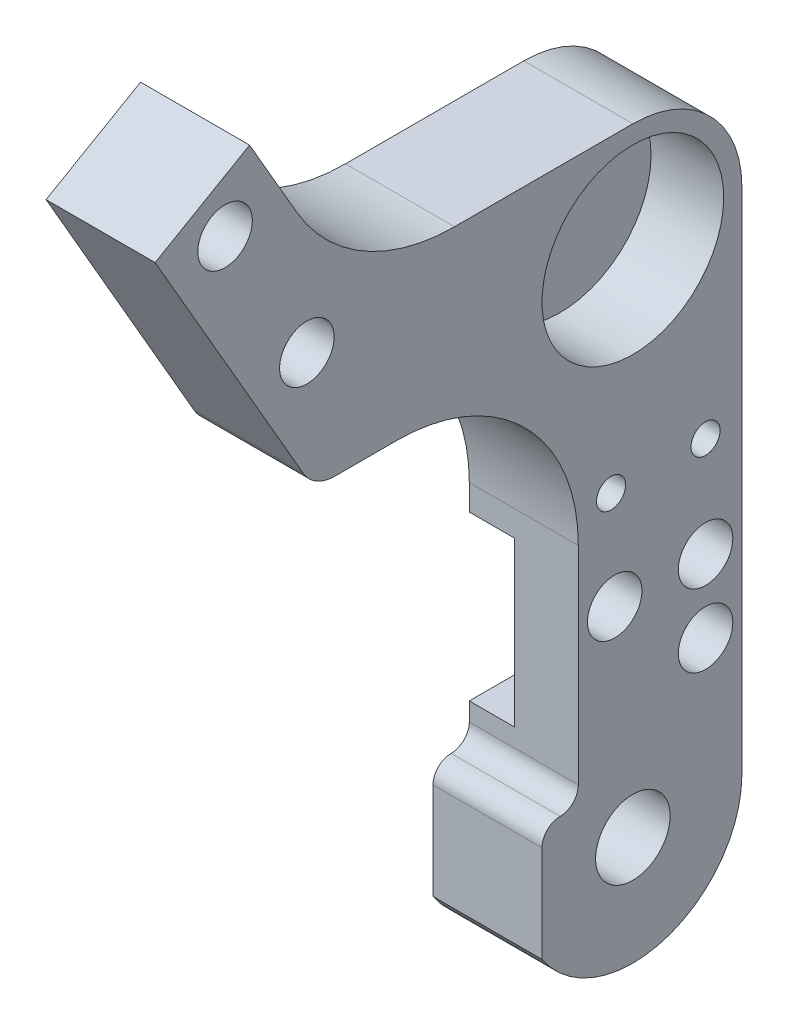
ISO-10303-21;
HEADER;
FILE_DESCRIPTION(('STEP AP214'),'2;1');
FILE_NAME('part.step','',(''),(''),'','','');
FILE_SCHEMA(('AUTOMOTIVE_DESIGN { 1 0 10303 214 1 1 1 1 }'));
ENDSEC;
DATA;
#1=APPLICATION_CONTEXT('core data for automotive mechanical design processes');
#2=APPLICATION_PROTOCOL_DEFINITION('international standard','automotive_design',2000,#1);
#3=PRODUCT_CONTEXT('',#1,'mechanical');
#4=PRODUCT('Part','Part','',(#3));
#5=PRODUCT_RELATED_PRODUCT_CATEGORY('part','',(#4));
#6=PRODUCT_DEFINITION_FORMATION('','',#4);
#7=PRODUCT_DEFINITION_CONTEXT('part definition',#1,'design');
#8=PRODUCT_DEFINITION('design','',#6,#7);
#9=PRODUCT_DEFINITION_SHAPE('','',#8);
#10=(LENGTH_UNIT() NAMED_UNIT(*) SI_UNIT(.MILLI.,.METRE.));
#11=(NAMED_UNIT(*) PLANE_ANGLE_UNIT() SI_UNIT($,.RADIAN.));
#12=(NAMED_UNIT(*) SI_UNIT($,.STERADIAN.) SOLID_ANGLE_UNIT());
#13=UNCERTAINTY_MEASURE_WITH_UNIT(LENGTH_MEASURE(1.E-05),#10,'distance_accuracy_value','');
#14=(GEOMETRIC_REPRESENTATION_CONTEXT(3) GLOBAL_UNCERTAINTY_ASSIGNED_CONTEXT((#13)) GLOBAL_UNIT_ASSIGNED_CONTEXT((#10,
#11,#12)) REPRESENTATION_CONTEXT('',''));
#15=CARTESIAN_POINT('',(0.,0.,0.));
#16=DIRECTION('',(0.,0.,1.));
#17=DIRECTION('',(1.,0.,0.));
#18=AXIS2_PLACEMENT_3D('',#15,#16,#17);
#19=CARTESIAN_POINT('',(0.,0.,0.));
#20=DIRECTION('',(-1.,0.,0.));
#21=DIRECTION('',(0.,0.,1.));
#22=AXIS2_PLACEMENT_3D('',#19,#20,#21);
#23=PLANE('',#22);
#24=DIRECTION('',(0.,0.,-1.));
#25=VECTOR('',#24,1.);
#26=CARTESIAN_POINT('',(0.,14.,-6.));
#27=LINE('',#26,#25);
#28=CARTESIAN_POINT('',(0.,14.,3.));
#29=VERTEX_POINT('',#28);
#30=CARTESIAN_POINT('',(0.,14.,-6.));
#31=VERTEX_POINT('',#30);
#32=EDGE_CURVE('E182',#29,#31,#27,.T.);
#33=ORIENTED_EDGE('',*,*,#32,.F.);
#34=DIRECTION('',(0.,-1.,0.));
#35=VECTOR('',#34,1.);
#36=CARTESIAN_POINT('',(0.,15.4051256642758,3.));
#37=LINE('',#36,#35);
#38=CARTESIAN_POINT('',(0.,15.4051256642758,3.));
#39=VERTEX_POINT('',#38);
#40=EDGE_CURVE('E293',#39,#29,#37,.T.);
#41=ORIENTED_EDGE('',*,*,#40,.F.);
#42=CARTESIAN_POINT('',(0.,15.4051256642758,13.));
#43=DIRECTION('',(-1.,0.,0.));
#44=DIRECTION('',(0.,0.,1.));
#45=AXIS2_PLACEMENT_3D('',#42,#43,#44);
#46=CIRCLE('',#45,10.);
#47=CARTESIAN_POINT('',(0.,25.4051256642758,13.));
#48=VERTEX_POINT('',#47);
#49=EDGE_CURVE('E290',#48,#39,#46,.T.);
#50=ORIENTED_EDGE('',*,*,#49,.F.);
#51=DIRECTION('',(0.,0.,-1.));
#52=VECTOR('',#51,1.);
#53=CARTESIAN_POINT('',(0.,25.4051256642758,16.3989745962155));
#54=LINE('',#53,#52);
#55=CARTESIAN_POINT('',(0.,25.4051256642758,16.3989745962155));
#56=VERTEX_POINT('',#55);
#57=EDGE_CURVE('E288',#56,#48,#54,.T.);
#58=ORIENTED_EDGE('',*,*,#57,.F.);
#59=CARTESIAN_POINT('',(0.,27.4051256642758,16.3989745962155));
#60=DIRECTION('',(1.,0.,0.));
#61=DIRECTION('',(0.,0.,-1.));
#62=AXIS2_PLACEMENT_3D('',#59,#60,#61);
#63=CIRCLE('',#62,2.);
#64=CARTESIAN_POINT('',(0.,26.4051256642758,18.1310254037844));
#65=VERTEX_POINT('',#64);
#66=EDGE_CURVE('E286',#65,#56,#63,.T.);
#67=ORIENTED_EDGE('',*,*,#66,.F.);
#68=DIRECTION('',(0.,-0.866025403784436,-0.500000000000004));
#69=VECTOR('',#68,1.);
#70=CARTESIAN_POINT('',(0.,40.53,26.2860254037844));
#71=LINE('',#70,#69);
#72=CARTESIAN_POINT('',(0.,40.53,26.2860254037844));
#73=VERTEX_POINT('',#72);
#74=EDGE_CURVE('E284',#73,#65,#71,.T.);
#75=ORIENTED_EDGE('',*,*,#74,.F.);
#76=DIRECTION('',(0.,-0.500000000000004,0.866025403784436));
#77=VECTOR('',#76,1.);
#78=CARTESIAN_POINT('',(0.,43.53,21.0898729810778));
#79=LINE('',#78,#77);
#80=CARTESIAN_POINT('',(0.,43.53,21.0898729810778));
#81=VERTEX_POINT('',#80);
#82=EDGE_CURVE('E282',#81,#73,#79,.T.);
#83=ORIENTED_EDGE('',*,*,#82,.F.);
#84=DIRECTION('',(0.,0.866025403784436,0.500000000000004));
#85=VECTOR('',#84,1.);
#86=CARTESIAN_POINT('',(0.,39.,18.4744762616488));
#87=LINE('',#86,#85);
#88=CARTESIAN_POINT('',(0.,39.,18.4744762616488));
#89=VERTEX_POINT('',#88);
#90=EDGE_CURVE('E280',#89,#81,#87,.T.);
#91=ORIENTED_EDGE('',*,*,#90,.F.);
#92=CARTESIAN_POINT('',(0.,44.,9.8142222238044));
#93=DIRECTION('',(-1.,0.,0.));
#94=DIRECTION('',(0.,0.,1.));
#95=AXIS2_PLACEMENT_3D('',#92,#93,#94);
#96=CIRCLE('',#95,10.);
#97=CARTESIAN_POINT('',(0.,34.,9.81422222380439));
#98=VERTEX_POINT('',#97);
#99=EDGE_CURVE('E278',#98,#89,#96,.T.);
#100=ORIENTED_EDGE('',*,*,#99,.F.);
#101=DIRECTION('',(0.,0.,1.));
#102=VECTOR('',#101,1.);
#103=CARTESIAN_POINT('',(0.,34.,0.));
#104=LINE('',#103,#102);
#105=CARTESIAN_POINT('',(0.,34.,0.));
#106=VERTEX_POINT('',#105);
#107=EDGE_CURVE('E276',#106,#98,#104,.T.);
#108=ORIENTED_EDGE('',*,*,#107,.F.);
#109=CARTESIAN_POINT('',(0.,28.,0.));
#110=DIRECTION('',(1.,0.,0.));
#111=DIRECTION('',(0.,0.,-1.));
#112=AXIS2_PLACEMENT_3D('',#109,#110,#111);
#113=CIRCLE('',#112,6.);
#114=CARTESIAN_POINT('',(0.,28.,-6.));
#115=VERTEX_POINT('',#114);
#116=EDGE_CURVE('E274',#115,#106,#113,.T.);
#117=ORIENTED_EDGE('',*,*,#116,.F.);
#118=DIRECTION('',(0.,1.,0.));
#119=VECTOR('',#118,1.);
#120=CARTESIAN_POINT('',(0.,0.,-6.));
#121=LINE('',#120,#119);
#122=EDGE_CURVE('E272',#31,#115,#121,.T.);
#123=ORIENTED_EDGE('',*,*,#122,.F.);
#124=EDGE_LOOP('',(#33,#41,#50,#58,#67,#75,#83,#91,#100,#108,#117,#123));
#125=FACE_BOUND('',#124,.T.);
#126=CARTESIAN_POINT('',(0.,39.8649364905389,22.4379491924311));
#127=DIRECTION('',(1.,0.,0.));
#128=DIRECTION('',(0.,0.,-1.));
#129=AXIS2_PLACEMENT_3D('',#126,#127,#128);
#130=CIRCLE('',#129,1.5);
#131=CARTESIAN_POINT('',(0.,39.8649364905389,20.9379491924311));
#132=VERTEX_POINT('',#131);
#133=EDGE_CURVE('E226',#132,#132,#130,.T.);
#134=ORIENTED_EDGE('',*,*,#133,.T.);
#135=EDGE_LOOP('',(#134));
#136=FACE_BOUND('',#135,.T.);
#137=CARTESIAN_POINT('',(0.,32.070707856479,17.9379491924311));
#138=DIRECTION('',(1.,0.,0.));
#139=DIRECTION('',(0.,0.,-1.));
#140=AXIS2_PLACEMENT_3D('',#137,#138,#139);
#141=CIRCLE('',#140,1.49999999999999);
#142=CARTESIAN_POINT('',(0.,32.070707856479,16.4379491924311));
#143=VERTEX_POINT('',#142);
#144=EDGE_CURVE('E222',#143,#143,#141,.T.);
#145=ORIENTED_EDGE('',*,*,#144,.T.);
#146=EDGE_LOOP('',(#145));
#147=FACE_BOUND('',#146,.T.);
#148=CARTESIAN_POINT('',(0.,17.,-4.));
#149=DIRECTION('',(-1.,0.,0.));
#150=DIRECTION('',(0.,0.,1.));
#151=AXIS2_PLACEMENT_3D('',#148,#149,#150);
#152=CIRCLE('',#151,0.799999999999993);
#153=CARTESIAN_POINT('',(0.,17.,-3.20000000000001));
#154=VERTEX_POINT('',#153);
#155=EDGE_CURVE('E209',#154,#154,#152,.T.);
#156=ORIENTED_EDGE('',*,*,#155,.F.);
#157=EDGE_LOOP('',(#156));
#158=FACE_BOUND('',#157,.T.);
#159=CARTESIAN_POINT('',(0.,17.,1.2));
#160=DIRECTION('',(-1.,0.,0.));
#161=DIRECTION('',(0.,0.,1.));
#162=AXIS2_PLACEMENT_3D('',#159,#160,#161);
#163=CIRCLE('',#162,0.799999999999993);
#164=CARTESIAN_POINT('',(0.,17.,1.99999999999999));
#165=VERTEX_POINT('',#164);
#166=EDGE_CURVE('E203',#165,#165,#163,.T.);
#167=ORIENTED_EDGE('',*,*,#166,.F.);
#168=EDGE_LOOP('',(#167));
#169=FACE_BOUND('',#168,.T.);
#170=ADVANCED_FACE('F35',(#125,#136,#147,#158,#169),#23,.T.);
#171=CARTESIAN_POINT('',(6.,0.,0.));
#172=DIRECTION('',(-1.,0.,0.));
#173=DIRECTION('',(0.,0.,1.));
#174=AXIS2_PLACEMENT_3D('',#171,#172,#173);
#175=PLANE('',#174);
#176=CARTESIAN_POINT('',(6.,28.,0.));
#177=DIRECTION('',(1.,0.,0.));
#178=DIRECTION('',(0.,0.,-1.));
#179=AXIS2_PLACEMENT_3D('',#176,#177,#178);
#180=CIRCLE('',#179,5.);
#181=CARTESIAN_POINT('',(6.,28.,-5.));
#182=VERTEX_POINT('',#181);
#183=EDGE_CURVE('E708',#182,#182,#180,.T.);
#184=ORIENTED_EDGE('',*,*,#183,.F.);
#185=EDGE_LOOP('',(#184));
#186=FACE_BOUND('',#185,.T.);
#187=CARTESIAN_POINT('',(6.,17.,-4.));
#188=DIRECTION('',(1.,0.,0.));
#189=DIRECTION('',(0.,0.,-1.));
#190=AXIS2_PLACEMENT_3D('',#187,#188,#189);
#191=CIRCLE('',#190,0.799999999999988);
#192=CARTESIAN_POINT('',(6.,17.,-4.79999999999999));
#193=VERTEX_POINT('',#192);
#194=EDGE_CURVE('E206',#193,#193,#191,.T.);
#195=ORIENTED_EDGE('',*,*,#194,.F.);
#196=EDGE_LOOP('',(#195));
#197=FACE_BOUND('',#196,.T.);
#198=CARTESIAN_POINT('',(6.,11.5,-4.));
#199=DIRECTION('',(1.,0.,0.));
#200=DIRECTION('',(0.,0.,-1.));
#201=AXIS2_PLACEMENT_3D('',#198,#199,#200);
#202=CIRCLE('',#201,1.5);
#203=CARTESIAN_POINT('',(6.,11.5,-5.5));
#204=VERTEX_POINT('',#203);
#205=EDGE_CURVE('E216',#204,#204,#202,.T.);
#206=ORIENTED_EDGE('',*,*,#205,.F.);
#207=EDGE_LOOP('',(#206));
#208=FACE_BOUND('',#207,.T.);
#209=CARTESIAN_POINT('',(6.,32.070707856479,17.9379491924311));
#210=DIRECTION('',(1.,0.,0.));
#211=DIRECTION('',(0.,0.,-1.));
#212=AXIS2_PLACEMENT_3D('',#209,#210,#211);
#213=CIRCLE('',#212,1.49999999999999);
#214=CARTESIAN_POINT('',(6.,32.070707856479,16.4379491924311));
#215=VERTEX_POINT('',#214);
#216=EDGE_CURVE('E223',#215,#215,#213,.T.);
#217=ORIENTED_EDGE('',*,*,#216,.F.);
#218=EDGE_LOOP('',(#217));
#219=FACE_BOUND('',#218,.T.);
#220=CARTESIAN_POINT('',(6.,0.,0.));
#221=DIRECTION('',(1.,0.,0.));
#222=DIRECTION('',(0.,0.,-1.));
#223=AXIS2_PLACEMENT_3D('',#220,#221,#222);
#224=CIRCLE('',#223,2.05);
#225=CARTESIAN_POINT('',(6.,0.,-2.05));
#226=VERTEX_POINT('',#225);
#227=EDGE_CURVE('E235',#226,#226,#224,.T.);
#228=ORIENTED_EDGE('',*,*,#227,.F.);
#229=EDGE_LOOP('',(#228));
#230=FACE_BOUND('',#229,.T.);
#231=DIRECTION('',(0.,-1.,0.));
#232=VECTOR('',#231,1.);
#233=CARTESIAN_POINT('',(6.,15.4051256642758,3.));
#234=LINE('',#233,#232);
#235=CARTESIAN_POINT('',(6.,15.4051256642758,3.));
#236=VERTEX_POINT('',#235);
#237=CARTESIAN_POINT('',(6.,4.,3.));
#238=VERTEX_POINT('',#237);
#239=EDGE_CURVE('E265',#236,#238,#234,.T.);
#240=ORIENTED_EDGE('',*,*,#239,.T.);
#241=CARTESIAN_POINT('',(6.,4.,4.));
#242=DIRECTION('',(-1.,0.,0.));
#243=DIRECTION('',(0.,0.,1.));
#244=AXIS2_PLACEMENT_3D('',#241,#242,#243);
#245=CIRCLE('',#244,1.);
#246=CARTESIAN_POINT('',(6.,3.,4.));
#247=VERTEX_POINT('',#246);
#248=EDGE_CURVE('E11',#238,#247,#245,.T.);
#249=ORIENTED_EDGE('',*,*,#248,.T.);
#250=CARTESIAN_POINT('',(6.,2.,4.));
#251=DIRECTION('',(-1.,0.,0.));
#252=DIRECTION('',(0.,0.,1.));
#253=AXIS2_PLACEMENT_3D('',#250,#251,#252);
#254=CIRCLE('',#253,1.);
#255=CARTESIAN_POINT('',(6.,2.,5.));
#256=VERTEX_POINT('',#255);
#257=EDGE_CURVE('E336',#247,#256,#254,.F.);
#258=ORIENTED_EDGE('',*,*,#257,.T.);
#259=DIRECTION('',(0.,-1.,0.));
#260=VECTOR('',#259,1.);
#261=CARTESIAN_POINT('',(6.,3.,5.));
#262=LINE('',#261,#260);
#263=CARTESIAN_POINT('',(6.,-3.3166247903554,5.));
#264=VERTEX_POINT('',#263);
#265=EDGE_CURVE('E267',#256,#264,#262,.T.);
#266=ORIENTED_EDGE('',*,*,#265,.T.);
#267=CARTESIAN_POINT('',(6.,0.,0.));
#268=DIRECTION('',(1.,0.,0.));
#269=DIRECTION('',(0.,0.,1.));
#270=AXIS2_PLACEMENT_3D('',#267,#268,#269);
#271=CIRCLE('',#270,6.);
#272=CARTESIAN_POINT('',(6.,0.,-6.));
#273=VERTEX_POINT('',#272);
#274=EDGE_CURVE('E241',#264,#273,#271,.T.);
#275=ORIENTED_EDGE('',*,*,#274,.T.);
#276=DIRECTION('',(0.,1.,0.));
#277=VECTOR('',#276,1.);
#278=CARTESIAN_POINT('',(6.,0.,-6.));
#279=LINE('',#278,#277);
#280=CARTESIAN_POINT('',(6.,28.,-6.));
#281=VERTEX_POINT('',#280);
#282=EDGE_CURVE('E244',#273,#281,#279,.T.);
#283=ORIENTED_EDGE('',*,*,#282,.T.);
#284=CARTESIAN_POINT('',(6.,28.,0.));
#285=DIRECTION('',(1.,0.,0.));
#286=DIRECTION('',(0.,0.,-1.));
#287=AXIS2_PLACEMENT_3D('',#284,#285,#286);
#288=CIRCLE('',#287,6.);
#289=CARTESIAN_POINT('',(6.,34.,0.));
#290=VERTEX_POINT('',#289);
#291=EDGE_CURVE('E247',#281,#290,#288,.T.);
#292=ORIENTED_EDGE('',*,*,#291,.T.);
#293=DIRECTION('',(0.,0.,1.));
#294=VECTOR('',#293,1.);
#295=CARTESIAN_POINT('',(6.,34.,0.));
#296=LINE('',#295,#294);
#297=CARTESIAN_POINT('',(6.,34.,9.81422222380439));
#298=VERTEX_POINT('',#297);
#299=EDGE_CURVE('E249',#290,#298,#296,.T.);
#300=ORIENTED_EDGE('',*,*,#299,.T.);
#301=CARTESIAN_POINT('',(6.,44.,9.8142222238044));
#302=DIRECTION('',(-1.,0.,0.));
#303=DIRECTION('',(0.,0.,1.));
#304=AXIS2_PLACEMENT_3D('',#301,#302,#303);
#305=CIRCLE('',#304,10.);
#306=CARTESIAN_POINT('',(6.,39.,18.4744762616488));
#307=VERTEX_POINT('',#306);
#308=EDGE_CURVE('E251',#298,#307,#305,.T.);
#309=ORIENTED_EDGE('',*,*,#308,.T.);
#310=DIRECTION('',(0.,0.866025403784436,0.500000000000004));
#311=VECTOR('',#310,1.);
#312=CARTESIAN_POINT('',(6.,39.,18.4744762616488));
#313=LINE('',#312,#311);
#314=CARTESIAN_POINT('',(6.,43.53,21.0898729810778));
#315=VERTEX_POINT('',#314);
#316=EDGE_CURVE('E253',#307,#315,#313,.T.);
#317=ORIENTED_EDGE('',*,*,#316,.T.);
#318=DIRECTION('',(0.,-0.500000000000004,0.866025403784436));
#319=VECTOR('',#318,1.);
#320=CARTESIAN_POINT('',(6.,43.53,21.0898729810778));
#321=LINE('',#320,#319);
#322=CARTESIAN_POINT('',(6.,40.53,26.2860254037844));
#323=VERTEX_POINT('',#322);
#324=EDGE_CURVE('E255',#315,#323,#321,.T.);
#325=ORIENTED_EDGE('',*,*,#324,.T.);
#326=DIRECTION('',(0.,-0.866025403784436,-0.500000000000004));
#327=VECTOR('',#326,1.);
#328=CARTESIAN_POINT('',(6.,40.53,26.2860254037844));
#329=LINE('',#328,#327);
#330=CARTESIAN_POINT('',(6.,26.4051256642758,18.1310254037844));
#331=VERTEX_POINT('',#330);
#332=EDGE_CURVE('E257',#323,#331,#329,.T.);
#333=ORIENTED_EDGE('',*,*,#332,.T.);
#334=CARTESIAN_POINT('',(6.,27.4051256642758,16.3989745962155));
#335=DIRECTION('',(1.,0.,0.));
#336=DIRECTION('',(0.,0.,-1.));
#337=AXIS2_PLACEMENT_3D('',#334,#335,#336);
#338=CIRCLE('',#337,2.);
#339=CARTESIAN_POINT('',(6.,25.4051256642758,16.3989745962155));
#340=VERTEX_POINT('',#339);
#341=EDGE_CURVE('E259',#331,#340,#338,.T.);
#342=ORIENTED_EDGE('',*,*,#341,.T.);
#343=DIRECTION('',(0.,0.,-1.));
#344=VECTOR('',#343,1.);
#345=CARTESIAN_POINT('',(6.,25.4051256642758,16.3989745962155));
#346=LINE('',#345,#344);
#347=CARTESIAN_POINT('',(6.,25.4051256642758,13.));
#348=VERTEX_POINT('',#347);
#349=EDGE_CURVE('E261',#340,#348,#346,.T.);
#350=ORIENTED_EDGE('',*,*,#349,.T.);
#351=CARTESIAN_POINT('',(6.,15.4051256642758,13.));
#352=DIRECTION('',(-1.,0.,0.));
#353=DIRECTION('',(0.,0.,1.));
#354=AXIS2_PLACEMENT_3D('',#351,#352,#353);
#355=CIRCLE('',#354,10.);
#356=EDGE_CURVE('E263',#348,#236,#355,.T.);
#357=ORIENTED_EDGE('',*,*,#356,.T.);
#358=EDGE_LOOP('',(#240,#249,#258,#266,#275,#283,#292,#300,#309,#317,#325,#333,#342,#350,#357));
#359=FACE_BOUND('',#358,.T.);
#360=CARTESIAN_POINT('',(6.,39.8649364905389,22.4379491924311));
#361=DIRECTION('',(1.,0.,0.));
#362=DIRECTION('',(0.,0.,-1.));
#363=AXIS2_PLACEMENT_3D('',#360,#361,#362);
#364=CIRCLE('',#363,1.5);
#365=CARTESIAN_POINT('',(6.,39.8649364905389,20.9379491924311));
#366=VERTEX_POINT('',#365);
#367=EDGE_CURVE('E229',#366,#366,#364,.T.);
#368=ORIENTED_EDGE('',*,*,#367,.F.);
#369=EDGE_LOOP('',(#368));
#370=FACE_BOUND('',#369,.T.);
#371=CARTESIAN_POINT('',(6.,11.5,1.));
#372=DIRECTION('',(1.,0.,0.));
#373=DIRECTION('',(0.,0.,-1.));
#374=AXIS2_PLACEMENT_3D('',#371,#372,#373);
#375=CIRCLE('',#374,1.5);
#376=CARTESIAN_POINT('',(6.,11.5,-0.5));
#377=VERTEX_POINT('',#376);
#378=EDGE_CURVE('E219',#377,#377,#375,.T.);
#379=ORIENTED_EDGE('',*,*,#378,.F.);
#380=EDGE_LOOP('',(#379));
#381=FACE_BOUND('',#380,.T.);
#382=CARTESIAN_POINT('',(6.,7.5,-4.));
#383=DIRECTION('',(1.,0.,0.));
#384=DIRECTION('',(0.,0.,-1.));
#385=AXIS2_PLACEMENT_3D('',#382,#383,#384);
#386=CIRCLE('',#385,1.5);
#387=CARTESIAN_POINT('',(6.,7.5,-5.5));
#388=VERTEX_POINT('',#387);
#389=EDGE_CURVE('E213',#388,#388,#386,.T.);
#390=ORIENTED_EDGE('',*,*,#389,.F.);
#391=EDGE_LOOP('',(#390));
#392=FACE_BOUND('',#391,.T.);
#393=CARTESIAN_POINT('',(6.,17.,1.2));
#394=DIRECTION('',(1.,0.,0.));
#395=DIRECTION('',(0.,0.,-1.));
#396=AXIS2_PLACEMENT_3D('',#393,#394,#395);
#397=CIRCLE('',#396,0.799999999999988);
#398=CARTESIAN_POINT('',(6.,17.,0.400000000000011));
#399=VERTEX_POINT('',#398);
#400=EDGE_CURVE('E200',#399,#399,#397,.T.);
#401=ORIENTED_EDGE('',*,*,#400,.F.);
#402=EDGE_LOOP('',(#401));
#403=FACE_BOUND('',#402,.T.);
#404=ADVANCED_FACE('F363',(#186,#197,#208,#219,#230,#359,#370,#381,#392,#403),#175,.F.);
#405=DIRECTION('',(0.,0.,1.));
#406=VECTOR('',#405,1.);
#407=CARTESIAN_POINT('',(0.,5.,-6.));
#408=LINE('',#407,#406);
#409=CARTESIAN_POINT('',(0.,5.,-6.));
#410=VERTEX_POINT('',#409);
#411=CARTESIAN_POINT('',(0.,5.,3.));
#412=VERTEX_POINT('',#411);
#413=EDGE_CURVE('E419',#410,#412,#408,.T.);
#414=ORIENTED_EDGE('',*,*,#413,.F.);
#415=CARTESIAN_POINT('',(0.,0.,-6.));
#416=VERTEX_POINT('',#415);
#417=EDGE_CURVE('E187',#416,#410,#121,.T.);
#418=ORIENTED_EDGE('',*,*,#417,.F.);
#419=CARTESIAN_POINT('',(0.,0.,0.));
#420=DIRECTION('',(1.,0.,0.));
#421=DIRECTION('',(0.,0.,1.));
#422=AXIS2_PLACEMENT_3D('',#419,#420,#421);
#423=CIRCLE('',#422,6.);
#424=CARTESIAN_POINT('',(0.,-3.3166247903554,5.));
#425=VERTEX_POINT('',#424);
#426=EDGE_CURVE('E238',#425,#416,#423,.T.);
#427=ORIENTED_EDGE('',*,*,#426,.F.);
#428=DIRECTION('',(0.,-1.,0.));
#429=VECTOR('',#428,1.);
#430=CARTESIAN_POINT('',(0.,3.,5.));
#431=LINE('',#430,#429);
#432=CARTESIAN_POINT('',(0.,2.,5.));
#433=VERTEX_POINT('',#432);
#434=EDGE_CURVE('E245',#433,#425,#431,.T.);
#435=ORIENTED_EDGE('',*,*,#434,.F.);
#436=CARTESIAN_POINT('',(0.,2.,4.));
#437=DIRECTION('',(-1.,0.,0.));
#438=DIRECTION('',(0.,0.,1.));
#439=AXIS2_PLACEMENT_3D('',#436,#437,#438);
#440=CIRCLE('',#439,1.);
#441=CARTESIAN_POINT('',(0.,3.,4.));
#442=VERTEX_POINT('',#441);
#443=EDGE_CURVE('E334',#433,#442,#440,.T.);
#444=ORIENTED_EDGE('',*,*,#443,.T.);
#445=CARTESIAN_POINT('',(0.,4.,4.));
#446=DIRECTION('',(-1.,0.,0.));
#447=DIRECTION('',(0.,0.,1.));
#448=AXIS2_PLACEMENT_3D('',#445,#446,#447);
#449=CIRCLE('',#448,1.);
#450=CARTESIAN_POINT('',(0.,4.,3.));
#451=VERTEX_POINT('',#450);
#452=EDGE_CURVE('E44',#442,#451,#449,.F.);
#453=ORIENTED_EDGE('',*,*,#452,.T.);
#454=EDGE_CURVE('E292',#412,#451,#37,.T.);
#455=ORIENTED_EDGE('',*,*,#454,.F.);
#456=EDGE_LOOP('',(#414,#418,#427,#435,#444,#453,#455));
#457=FACE_BOUND('',#456,.T.);
#458=CARTESIAN_POINT('',(0.,0.,0.));
#459=DIRECTION('',(1.,0.,0.));
#460=DIRECTION('',(0.,0.,-1.));
#461=AXIS2_PLACEMENT_3D('',#458,#459,#460);
#462=CIRCLE('',#461,2.05);
#463=CARTESIAN_POINT('',(0.,0.,-2.05));
#464=VERTEX_POINT('',#463);
#465=EDGE_CURVE('E232',#464,#464,#462,.T.);
#466=ORIENTED_EDGE('',*,*,#465,.T.);
#467=EDGE_LOOP('',(#466));
#468=FACE_BOUND('',#467,.T.);
#469=ADVANCED_FACE('F351',(#457,#468),#23,.T.);
#470=CARTESIAN_POINT('',(6.,0.,0.));
#471=DIRECTION('',(-1.,0.,0.));
#472=DIRECTION('',(0.,0.,1.));
#473=AXIS2_PLACEMENT_3D('',#470,#471,#472);
#474=CYLINDRICAL_SURFACE('',#473,6.);
#475=ORIENTED_EDGE('',*,*,#426,.T.);
#476=DIRECTION('',(-1.,0.,0.));
#477=VECTOR('',#476,1.);
#478=CARTESIAN_POINT('',(6.,0.,-6.));
#479=LINE('',#478,#477);
#480=EDGE_CURVE('E329',#273,#416,#479,.T.);
#481=ORIENTED_EDGE('',*,*,#480,.F.);
#482=ORIENTED_EDGE('',*,*,#274,.F.);
#483=DIRECTION('',(-1.,0.,0.));
#484=VECTOR('',#483,1.);
#485=CARTESIAN_POINT('',(6.,-3.3166247903554,5.));
#486=LINE('',#485,#484);
#487=EDGE_CURVE('E269',#264,#425,#486,.T.);
#488=ORIENTED_EDGE('',*,*,#487,.T.);
#489=EDGE_LOOP('',(#475,#481,#482,#488));
#490=FACE_BOUND('',#489,.T.);
#491=ADVANCED_FACE('F361',(#490),#474,.T.);
#492=CARTESIAN_POINT('',(6.,0.,-6.));
#493=DIRECTION('',(0.,0.,1.));
#494=DIRECTION('',(0.,-1.,0.));
#495=AXIS2_PLACEMENT_3D('',#492,#493,#494);
#496=PLANE('',#495);
#497=DIRECTION('',(0.,-1.,0.));
#498=VECTOR('',#497,1.);
#499=CARTESIAN_POINT('',(2.5,5.,-6.));
#500=LINE('',#499,#498);
#501=CARTESIAN_POINT('',(2.5,14.,-6.));
#502=VERTEX_POINT('',#501);
#503=CARTESIAN_POINT('',(2.5,5.,-6.));
#504=VERTEX_POINT('',#503);
#505=EDGE_CURVE('E173',#502,#504,#500,.T.);
#506=ORIENTED_EDGE('',*,*,#505,.F.);
#507=DIRECTION('',(-1.,0.,0.));
#508=VECTOR('',#507,1.);
#509=CARTESIAN_POINT('',(2.5,14.,-6.));
#510=LINE('',#509,#508);
#511=EDGE_CURVE('E423',#502,#31,#510,.T.);
#512=ORIENTED_EDGE('',*,*,#511,.T.);
#513=ORIENTED_EDGE('',*,*,#122,.T.);
#514=DIRECTION('',(-1.,0.,0.));
#515=VECTOR('',#514,1.);
#516=CARTESIAN_POINT('',(6.,28.,-6.));
#517=LINE('',#516,#515);
#518=EDGE_CURVE('E326',#281,#115,#517,.T.);
#519=ORIENTED_EDGE('',*,*,#518,.F.);
#520=ORIENTED_EDGE('',*,*,#282,.F.);
#521=ORIENTED_EDGE('',*,*,#480,.T.);
#522=ORIENTED_EDGE('',*,*,#417,.T.);
#523=DIRECTION('',(-1.,0.,0.));
#524=VECTOR('',#523,1.);
#525=CARTESIAN_POINT('',(2.5,5.,-6.));
#526=LINE('',#525,#524);
#527=EDGE_CURVE('E167',#504,#410,#526,.T.);
#528=ORIENTED_EDGE('',*,*,#527,.F.);
#529=EDGE_LOOP('',(#506,#512,#513,#519,#520,#521,#522,#528));
#530=FACE_BOUND('',#529,.T.);
#531=ADVANCED_FACE('F185',(#530),#496,.F.);
#532=CARTESIAN_POINT('',(6.,28.,0.));
#533=DIRECTION('',(-1.,0.,0.));
#534=DIRECTION('',(0.,0.,1.));
#535=AXIS2_PLACEMENT_3D('',#532,#533,#534);
#536=CYLINDRICAL_SURFACE('',#535,6.);
#537=ORIENTED_EDGE('',*,*,#116,.T.);
#538=DIRECTION('',(-1.,0.,0.));
#539=VECTOR('',#538,1.);
#540=CARTESIAN_POINT('',(6.,34.,0.));
#541=LINE('',#540,#539);
#542=EDGE_CURVE('E323',#290,#106,#541,.T.);
#543=ORIENTED_EDGE('',*,*,#542,.F.);
#544=ORIENTED_EDGE('',*,*,#291,.F.);
#545=ORIENTED_EDGE('',*,*,#518,.T.);
#546=EDGE_LOOP('',(#537,#543,#544,#545));
#547=FACE_BOUND('',#546,.T.);
#548=ADVANCED_FACE('F371',(#547),#536,.T.);
#549=CARTESIAN_POINT('',(6.,34.,0.));
#550=DIRECTION('',(0.,-1.,0.));
#551=DIRECTION('',(0.,0.,-1.));
#552=AXIS2_PLACEMENT_3D('',#549,#550,#551);
#553=PLANE('',#552);
#554=ORIENTED_EDGE('',*,*,#107,.T.);
#555=DIRECTION('',(-1.,0.,0.));
#556=VECTOR('',#555,1.);
#557=CARTESIAN_POINT('',(6.,34.,9.81422222380439));
#558=LINE('',#557,#556);
#559=EDGE_CURVE('E320',#298,#98,#558,.T.);
#560=ORIENTED_EDGE('',*,*,#559,.F.);
#561=ORIENTED_EDGE('',*,*,#299,.F.);
#562=ORIENTED_EDGE('',*,*,#542,.T.);
#563=EDGE_LOOP('',(#554,#560,#561,#562));
#564=FACE_BOUND('',#563,.T.);
#565=ADVANCED_FACE('F376',(#564),#553,.F.);
#566=CARTESIAN_POINT('',(6.,44.,9.8142222238044));
#567=DIRECTION('',(-1.,0.,0.));
#568=DIRECTION('',(0.,0.,1.));
#569=AXIS2_PLACEMENT_3D('',#566,#567,#568);
#570=CYLINDRICAL_SURFACE('',#569,10.);
#571=ORIENTED_EDGE('',*,*,#99,.T.);
#572=DIRECTION('',(-1.,0.,0.));
#573=VECTOR('',#572,1.);
#574=CARTESIAN_POINT('',(6.,39.,18.4744762616488));
#575=LINE('',#574,#573);
#576=EDGE_CURVE('E317',#307,#89,#575,.T.);
#577=ORIENTED_EDGE('',*,*,#576,.F.);
#578=ORIENTED_EDGE('',*,*,#308,.F.);
#579=ORIENTED_EDGE('',*,*,#559,.T.);
#580=EDGE_LOOP('',(#571,#577,#578,#579));
#581=FACE_BOUND('',#580,.T.);
#582=ADVANCED_FACE('F382',(#581),#570,.F.);
#583=CARTESIAN_POINT('',(6.,39.,18.4744762616488));
#584=DIRECTION('',(0.,-0.500000000000004,0.866025403784436));
#585=DIRECTION('',(0.,-0.866025403784436,-0.500000000000004));
#586=AXIS2_PLACEMENT_3D('',#583,#584,#585);
#587=PLANE('',#586);
#588=ORIENTED_EDGE('',*,*,#90,.T.);
#589=DIRECTION('',(-1.,0.,0.));
#590=VECTOR('',#589,1.);
#591=CARTESIAN_POINT('',(6.,43.53,21.0898729810778));
#592=LINE('',#591,#590);
#593=EDGE_CURVE('E314',#315,#81,#592,.T.);
#594=ORIENTED_EDGE('',*,*,#593,.F.);
#595=ORIENTED_EDGE('',*,*,#316,.F.);
#596=ORIENTED_EDGE('',*,*,#576,.T.);
#597=EDGE_LOOP('',(#588,#594,#595,#596));
#598=FACE_BOUND('',#597,.T.);
#599=ADVANCED_FACE('F386',(#598),#587,.F.);
#600=CARTESIAN_POINT('',(6.,43.53,21.0898729810778));
#601=DIRECTION('',(0.,-0.866025403784436,-0.500000000000004));
#602=DIRECTION('',(0.,0.500000000000004,-0.866025403784436));
#603=AXIS2_PLACEMENT_3D('',#600,#601,#602);
#604=PLANE('',#603);
#605=ORIENTED_EDGE('',*,*,#82,.T.);
#606=DIRECTION('',(-1.,0.,0.));
#607=VECTOR('',#606,1.);
#608=CARTESIAN_POINT('',(6.,40.53,26.2860254037844));
#609=LINE('',#608,#607);
#610=EDGE_CURVE('E311',#323,#73,#609,.T.);
#611=ORIENTED_EDGE('',*,*,#610,.F.);
#612=ORIENTED_EDGE('',*,*,#324,.F.);
#613=ORIENTED_EDGE('',*,*,#593,.T.);
#614=EDGE_LOOP('',(#605,#611,#612,#613));
#615=FACE_BOUND('',#614,.T.);
#616=ADVANCED_FACE('F391',(#615),#604,.F.);
#617=CARTESIAN_POINT('',(6.,40.53,26.2860254037844));
#618=DIRECTION('',(0.,0.500000000000004,-0.866025403784436));
#619=DIRECTION('',(0.,0.866025403784436,0.500000000000004));
#620=AXIS2_PLACEMENT_3D('',#617,#618,#619);
#621=PLANE('',#620);
#622=ORIENTED_EDGE('',*,*,#74,.T.);
#623=DIRECTION('',(-1.,0.,0.));
#624=VECTOR('',#623,1.);
#625=CARTESIAN_POINT('',(6.,26.4051256642758,18.1310254037844));
#626=LINE('',#625,#624);
#627=EDGE_CURVE('E308',#331,#65,#626,.T.);
#628=ORIENTED_EDGE('',*,*,#627,.F.);
#629=ORIENTED_EDGE('',*,*,#332,.F.);
#630=ORIENTED_EDGE('',*,*,#610,.T.);
#631=EDGE_LOOP('',(#622,#628,#629,#630));
#632=FACE_BOUND('',#631,.T.);
#633=ADVANCED_FACE('F397',(#632),#621,.F.);
#634=CARTESIAN_POINT('',(6.,27.4051256642758,16.3989745962155));
#635=DIRECTION('',(-1.,0.,0.));
#636=DIRECTION('',(0.,0.,1.));
#637=AXIS2_PLACEMENT_3D('',#634,#635,#636);
#638=CYLINDRICAL_SURFACE('',#637,2.);
#639=ORIENTED_EDGE('',*,*,#66,.T.);
#640=DIRECTION('',(-1.,0.,0.));
#641=VECTOR('',#640,1.);
#642=CARTESIAN_POINT('',(6.,25.4051256642758,16.3989745962155));
#643=LINE('',#642,#641);
#644=EDGE_CURVE('E305',#340,#56,#643,.T.);
#645=ORIENTED_EDGE('',*,*,#644,.F.);
#646=ORIENTED_EDGE('',*,*,#341,.F.);
#647=ORIENTED_EDGE('',*,*,#627,.T.);
#648=EDGE_LOOP('',(#639,#645,#646,#647));
#649=FACE_BOUND('',#648,.T.);
#650=ADVANCED_FACE('F401',(#649),#638,.T.);
#651=CARTESIAN_POINT('',(6.,25.4051256642758,16.3989745962155));
#652=DIRECTION('',(0.,1.,0.));
#653=DIRECTION('',(0.,0.,1.));
#654=AXIS2_PLACEMENT_3D('',#651,#652,#653);
#655=PLANE('',#654);
#656=ORIENTED_EDGE('',*,*,#57,.T.);
#657=DIRECTION('',(-1.,0.,0.));
#658=VECTOR('',#657,1.);
#659=CARTESIAN_POINT('',(6.,25.4051256642758,13.));
#660=LINE('',#659,#658);
#661=EDGE_CURVE('E302',#348,#48,#660,.T.);
#662=ORIENTED_EDGE('',*,*,#661,.F.);
#663=ORIENTED_EDGE('',*,*,#349,.F.);
#664=ORIENTED_EDGE('',*,*,#644,.T.);
#665=EDGE_LOOP('',(#656,#662,#663,#664));
#666=FACE_BOUND('',#665,.T.);
#667=ADVANCED_FACE('F406',(#666),#655,.F.);
#668=CARTESIAN_POINT('',(6.,15.4051256642758,13.));
#669=DIRECTION('',(-1.,0.,0.));
#670=DIRECTION('',(0.,0.,1.));
#671=AXIS2_PLACEMENT_3D('',#668,#669,#670);
#672=CYLINDRICAL_SURFACE('',#671,10.);
#673=ORIENTED_EDGE('',*,*,#49,.T.);
#674=DIRECTION('',(-1.,0.,0.));
#675=VECTOR('',#674,1.);
#676=CARTESIAN_POINT('',(6.,15.4051256642758,3.));
#677=LINE('',#676,#675);
#678=EDGE_CURVE('E299',#236,#39,#677,.T.);
#679=ORIENTED_EDGE('',*,*,#678,.F.);
#680=ORIENTED_EDGE('',*,*,#356,.F.);
#681=ORIENTED_EDGE('',*,*,#661,.T.);
#682=EDGE_LOOP('',(#673,#679,#680,#681));
#683=FACE_BOUND('',#682,.T.);
#684=ADVANCED_FACE('F411',(#683),#672,.F.);
#685=CARTESIAN_POINT('',(6.,15.4051256642758,3.));
#686=DIRECTION('',(0.,0.,-1.));
#687=DIRECTION('',(0.,1.,0.));
#688=AXIS2_PLACEMENT_3D('',#685,#686,#687);
#689=PLANE('',#688);
#690=ORIENTED_EDGE('',*,*,#40,.T.);
#691=DIRECTION('',(-1.,0.,0.));
#692=VECTOR('',#691,1.);
#693=CARTESIAN_POINT('',(2.5,14.,3.));
#694=LINE('',#693,#692);
#695=CARTESIAN_POINT('',(2.5,14.,3.));
#696=VERTEX_POINT('',#695);
#697=EDGE_CURVE('E189',#696,#29,#694,.T.);
#698=ORIENTED_EDGE('',*,*,#697,.F.);
#699=DIRECTION('',(0.,1.,0.));
#700=VECTOR('',#699,1.);
#701=CARTESIAN_POINT('',(2.5,5.,3.));
#702=LINE('',#701,#700);
#703=CARTESIAN_POINT('',(2.5,5.,3.));
#704=VERTEX_POINT('',#703);
#705=EDGE_CURVE('E172',#704,#696,#702,.T.);
#706=ORIENTED_EDGE('',*,*,#705,.F.);
#707=DIRECTION('',(-1.,0.,0.));
#708=VECTOR('',#707,1.);
#709=CARTESIAN_POINT('',(2.5,5.,3.));
#710=LINE('',#709,#708);
#711=EDGE_CURVE('E170',#704,#412,#710,.T.);
#712=ORIENTED_EDGE('',*,*,#711,.T.);
#713=ORIENTED_EDGE('',*,*,#454,.T.);
#714=DIRECTION('',(-1.,0.,0.));
#715=VECTOR('',#714,1.);
#716=CARTESIAN_POINT('',(6.,4.,3.));
#717=LINE('',#716,#715);
#718=EDGE_CURVE('E338',#451,#238,#717,.F.);
#719=ORIENTED_EDGE('',*,*,#718,.T.);
#720=ORIENTED_EDGE('',*,*,#239,.F.);
#721=ORIENTED_EDGE('',*,*,#678,.T.);
#722=EDGE_LOOP('',(#690,#698,#706,#712,#713,#719,#720,#721));
#723=FACE_BOUND('',#722,.T.);
#724=ADVANCED_FACE('F415',(#723),#689,.F.);
#725=CARTESIAN_POINT('',(6.,3.,5.));
#726=DIRECTION('',(0.,0.,-1.));
#727=DIRECTION('',(0.,1.,0.));
#728=AXIS2_PLACEMENT_3D('',#725,#726,#727);
#729=PLANE('',#728);
#730=ORIENTED_EDGE('',*,*,#265,.F.);
#731=DIRECTION('',(-1.,0.,0.));
#732=VECTOR('',#731,1.);
#733=CARTESIAN_POINT('',(6.,2.,5.));
#734=LINE('',#733,#732);
#735=EDGE_CURVE('E331',#256,#433,#734,.T.);
#736=ORIENTED_EDGE('',*,*,#735,.T.);
#737=ORIENTED_EDGE('',*,*,#434,.T.);
#738=ORIENTED_EDGE('',*,*,#487,.F.);
#739=EDGE_LOOP('',(#730,#736,#737,#738));
#740=FACE_BOUND('',#739,.T.);
#741=ADVANCED_FACE('F358',(#740),#729,.F.);
#742=CARTESIAN_POINT('',(6.,0.,0.));
#743=DIRECTION('',(-1.,0.,0.));
#744=DIRECTION('',(0.,0.,1.));
#745=AXIS2_PLACEMENT_3D('',#742,#743,#744);
#746=CYLINDRICAL_SURFACE('',#745,2.05);
#747=ORIENTED_EDGE('',*,*,#227,.T.);
#748=EDGE_LOOP('',(#747));
#749=FACE_BOUND('',#748,.T.);
#750=ORIENTED_EDGE('',*,*,#465,.F.);
#751=EDGE_LOOP('',(#750));
#752=FACE_BOUND('',#751,.T.);
#753=ADVANCED_FACE('F472',(#749,#752),#746,.F.);
#754=CARTESIAN_POINT('',(6.,39.8649364905389,22.4379491924311));
#755=DIRECTION('',(-1.,0.,0.));
#756=DIRECTION('',(0.,0.,1.));
#757=AXIS2_PLACEMENT_3D('',#754,#755,#756);
#758=CYLINDRICAL_SURFACE('',#757,1.5);
#759=ORIENTED_EDGE('',*,*,#367,.T.);
#760=EDGE_LOOP('',(#759));
#761=FACE_BOUND('',#760,.T.);
#762=ORIENTED_EDGE('',*,*,#133,.F.);
#763=EDGE_LOOP('',(#762));
#764=FACE_BOUND('',#763,.T.);
#765=ADVANCED_FACE('F468',(#761,#764),#758,.F.);
#766=CARTESIAN_POINT('',(6.,32.070707856479,17.9379491924311));
#767=DIRECTION('',(-1.,0.,0.));
#768=DIRECTION('',(0.,0.,1.));
#769=AXIS2_PLACEMENT_3D('',#766,#767,#768);
#770=CYLINDRICAL_SURFACE('',#769,1.49999999999999);
#771=ORIENTED_EDGE('',*,*,#216,.T.);
#772=EDGE_LOOP('',(#771));
#773=FACE_BOUND('',#772,.T.);
#774=ORIENTED_EDGE('',*,*,#144,.F.);
#775=EDGE_LOOP('',(#774));
#776=FACE_BOUND('',#775,.T.);
#777=ADVANCED_FACE('F464',(#773,#776),#770,.F.);
#778=CARTESIAN_POINT('',(6.,11.5,1.));
#779=DIRECTION('',(-1.,0.,0.));
#780=DIRECTION('',(0.,0.,1.));
#781=AXIS2_PLACEMENT_3D('',#778,#779,#780);
#782=CYLINDRICAL_SURFACE('',#781,1.5);
#783=CARTESIAN_POINT('',(2.5,11.5,1.));
#784=DIRECTION('',(1.,0.,0.));
#785=DIRECTION('',(0.,0.,-1.));
#786=AXIS2_PLACEMENT_3D('',#783,#784,#785);
#787=CIRCLE('',#786,1.5);
#788=CARTESIAN_POINT('',(2.5,11.5,-0.5));
#789=VERTEX_POINT('',#788);
#790=EDGE_CURVE('E197',#789,#789,#787,.T.);
#791=ORIENTED_EDGE('',*,*,#790,.F.);
#792=EDGE_LOOP('',(#791));
#793=FACE_BOUND('',#792,.T.);
#794=ORIENTED_EDGE('',*,*,#378,.T.);
#795=EDGE_LOOP('',(#794));
#796=FACE_BOUND('',#795,.T.);
#797=ADVANCED_FACE('F460',(#793,#796),#782,.F.);
#798=CARTESIAN_POINT('',(6.,11.5,-4.));
#799=DIRECTION('',(-1.,0.,0.));
#800=DIRECTION('',(0.,0.,1.));
#801=AXIS2_PLACEMENT_3D('',#798,#799,#800);
#802=CYLINDRICAL_SURFACE('',#801,1.5);
#803=CARTESIAN_POINT('',(2.5,11.5,-4.));
#804=DIRECTION('',(1.,0.,0.));
#805=DIRECTION('',(0.,0.,-1.));
#806=AXIS2_PLACEMENT_3D('',#803,#804,#805);
#807=CIRCLE('',#806,1.5);
#808=CARTESIAN_POINT('',(2.5,11.5,-5.5));
#809=VERTEX_POINT('',#808);
#810=EDGE_CURVE('E194',#809,#809,#807,.T.);
#811=ORIENTED_EDGE('',*,*,#810,.F.);
#812=EDGE_LOOP('',(#811));
#813=FACE_BOUND('',#812,.T.);
#814=ORIENTED_EDGE('',*,*,#205,.T.);
#815=EDGE_LOOP('',(#814));
#816=FACE_BOUND('',#815,.T.);
#817=ADVANCED_FACE('F456',(#813,#816),#802,.F.);
#818=CARTESIAN_POINT('',(6.,7.5,-4.));
#819=DIRECTION('',(-1.,0.,0.));
#820=DIRECTION('',(0.,0.,1.));
#821=AXIS2_PLACEMENT_3D('',#818,#819,#820);
#822=CYLINDRICAL_SURFACE('',#821,1.5);
#823=CARTESIAN_POINT('',(2.5,7.5,-4.));
#824=DIRECTION('',(1.,0.,0.));
#825=DIRECTION('',(0.,0.,-1.));
#826=AXIS2_PLACEMENT_3D('',#823,#824,#825);
#827=CIRCLE('',#826,1.5);
#828=CARTESIAN_POINT('',(2.5,7.5,-5.5));
#829=VERTEX_POINT('',#828);
#830=EDGE_CURVE('E39',#829,#829,#827,.T.);
#831=ORIENTED_EDGE('',*,*,#830,.F.);
#832=EDGE_LOOP('',(#831));
#833=FACE_BOUND('',#832,.T.);
#834=ORIENTED_EDGE('',*,*,#389,.T.);
#835=EDGE_LOOP('',(#834));
#836=FACE_BOUND('',#835,.T.);
#837=ADVANCED_FACE('F453',(#833,#836),#822,.F.);
#838=CARTESIAN_POINT('',(6.,4.,4.));
#839=DIRECTION('',(1.,0.,0.));
#840=DIRECTION('',(0.,0.,-1.));
#841=AXIS2_PLACEMENT_3D('',#838,#839,#840);
#842=CYLINDRICAL_SURFACE('',#841,1.);
#843=DIRECTION('',(-1.,0.,0.));
#844=VECTOR('',#843,1.);
#845=CARTESIAN_POINT('',(0.,3.,4.));
#846=LINE('',#845,#844);
#847=EDGE_CURVE('E212',#247,#442,#846,.T.);
#848=ORIENTED_EDGE('',*,*,#847,.F.);
#849=ORIENTED_EDGE('',*,*,#248,.F.);
#850=ORIENTED_EDGE('',*,*,#718,.F.);
#851=ORIENTED_EDGE('',*,*,#452,.F.);
#852=EDGE_LOOP('',(#848,#849,#850,#851));
#853=FACE_BOUND('',#852,.T.);
#854=ADVANCED_FACE('F37',(#853),#842,.F.);
#855=CARTESIAN_POINT('',(6.,2.,4.));
#856=DIRECTION('',(-1.,0.,0.));
#857=DIRECTION('',(0.,0.,1.));
#858=AXIS2_PLACEMENT_3D('',#855,#856,#857);
#859=CYLINDRICAL_SURFACE('',#858,1.);
#860=ORIENTED_EDGE('',*,*,#257,.F.);
#861=ORIENTED_EDGE('',*,*,#847,.T.);
#862=ORIENTED_EDGE('',*,*,#443,.F.);
#863=ORIENTED_EDGE('',*,*,#735,.F.);
#864=EDGE_LOOP('',(#860,#861,#862,#863));
#865=FACE_BOUND('',#864,.T.);
#866=ADVANCED_FACE('F344',(#865),#859,.T.);
#867=CARTESIAN_POINT('',(6.,17.,-4.));
#868=DIRECTION('',(1.,0.,0.));
#869=DIRECTION('',(0.,0.,-1.));
#870=AXIS2_PLACEMENT_3D('',#867,#868,#869);
#871=CYLINDRICAL_SURFACE('',#870,0.799999999999993);
#872=ORIENTED_EDGE('',*,*,#194,.T.);
#873=EDGE_LOOP('',(#872));
#874=FACE_BOUND('',#873,.T.);
#875=ORIENTED_EDGE('',*,*,#155,.T.);
#876=EDGE_LOOP('',(#875));
#877=FACE_BOUND('',#876,.T.);
#878=ADVANCED_FACE('F441',(#874,#877),#871,.F.);
#879=CARTESIAN_POINT('',(6.,17.,1.2));
#880=DIRECTION('',(1.,0.,0.));
#881=DIRECTION('',(0.,0.,-1.));
#882=AXIS2_PLACEMENT_3D('',#879,#880,#881);
#883=CYLINDRICAL_SURFACE('',#882,0.799999999999993);
#884=ORIENTED_EDGE('',*,*,#400,.T.);
#885=EDGE_LOOP('',(#884));
#886=FACE_BOUND('',#885,.T.);
#887=ORIENTED_EDGE('',*,*,#166,.T.);
#888=EDGE_LOOP('',(#887));
#889=FACE_BOUND('',#888,.T.);
#890=ADVANCED_FACE('F439',(#886,#889),#883,.F.);
#891=CARTESIAN_POINT('',(2.5,14.,-6.));
#892=DIRECTION('',(0.,1.,0.));
#893=DIRECTION('',(0.,0.,1.));
#894=AXIS2_PLACEMENT_3D('',#891,#892,#893);
#895=PLANE('',#894);
#896=ORIENTED_EDGE('',*,*,#32,.T.);
#897=ORIENTED_EDGE('',*,*,#511,.F.);
#898=DIRECTION('',(0.,0.,-1.));
#899=VECTOR('',#898,1.);
#900=CARTESIAN_POINT('',(2.5,14.,-6.));
#901=LINE('',#900,#899);
#902=EDGE_CURVE('E179',#696,#502,#901,.T.);
#903=ORIENTED_EDGE('',*,*,#902,.F.);
#904=ORIENTED_EDGE('',*,*,#697,.T.);
#905=EDGE_LOOP('',(#896,#897,#903,#904));
#906=FACE_BOUND('',#905,.T.);
#907=ADVANCED_FACE('F426',(#906),#895,.F.);
#908=CARTESIAN_POINT('',(2.5,5.,-6.));
#909=DIRECTION('',(0.,-1.,0.));
#910=DIRECTION('',(0.,0.,-1.));
#911=AXIS2_PLACEMENT_3D('',#908,#909,#910);
#912=PLANE('',#911);
#913=ORIENTED_EDGE('',*,*,#413,.T.);
#914=ORIENTED_EDGE('',*,*,#711,.F.);
#915=DIRECTION('',(0.,0.,1.));
#916=VECTOR('',#915,1.);
#917=CARTESIAN_POINT('',(2.5,5.,-6.));
#918=LINE('',#917,#916);
#919=EDGE_CURVE('E52',#504,#704,#918,.T.);
#920=ORIENTED_EDGE('',*,*,#919,.F.);
#921=ORIENTED_EDGE('',*,*,#527,.T.);
#922=EDGE_LOOP('',(#913,#914,#920,#921));
#923=FACE_BOUND('',#922,.T.);
#924=ADVANCED_FACE('F165',(#923),#912,.F.);
#925=CARTESIAN_POINT('',(2.5,0.,0.));
#926=DIRECTION('',(1.,0.,0.));
#927=DIRECTION('',(0.,0.,-1.));
#928=AXIS2_PLACEMENT_3D('',#925,#926,#927);
#929=PLANE('',#928);
#930=ORIENTED_EDGE('',*,*,#790,.T.);
#931=EDGE_LOOP('',(#930));
#932=FACE_BOUND('',#931,.T.);
#933=ORIENTED_EDGE('',*,*,#810,.T.);
#934=EDGE_LOOP('',(#933));
#935=FACE_BOUND('',#934,.T.);
#936=ORIENTED_EDGE('',*,*,#830,.T.);
#937=EDGE_LOOP('',(#936));
#938=FACE_BOUND('',#937,.T.);
#939=ORIENTED_EDGE('',*,*,#505,.T.);
#940=ORIENTED_EDGE('',*,*,#919,.T.);
#941=ORIENTED_EDGE('',*,*,#705,.T.);
#942=ORIENTED_EDGE('',*,*,#902,.T.);
#943=EDGE_LOOP('',(#939,#940,#941,#942));
#944=FACE_BOUND('',#943,.T.);
#945=ADVANCED_FACE('F177',(#932,#935,#938,#944),#929,.F.);
#946=CARTESIAN_POINT('',(2.,28.,0.));
#947=DIRECTION('',(1.,0.,0.));
#948=DIRECTION('',(0.,0.,-1.));
#949=AXIS2_PLACEMENT_3D('',#946,#947,#948);
#950=CYLINDRICAL_SURFACE('',#949,5.);
#951=CARTESIAN_POINT('',(2.,28.,0.));
#952=DIRECTION('',(1.,0.,0.));
#953=DIRECTION('',(0.,0.,-1.));
#954=AXIS2_PLACEMENT_3D('',#951,#952,#953);
#955=CIRCLE('',#954,5.);
#956=CARTESIAN_POINT('',(2.,28.,-5.));
#957=VERTEX_POINT('',#956);
#958=EDGE_CURVE('E421',#957,#957,#955,.T.);
#959=ORIENTED_EDGE('',*,*,#958,.F.);
#960=EDGE_LOOP('',(#959));
#961=FACE_BOUND('',#960,.T.);
#962=ORIENTED_EDGE('',*,*,#183,.T.);
#963=EDGE_LOOP('',(#962));
#964=FACE_BOUND('',#963,.T.);
#965=ADVANCED_FACE('F682',(#961,#964),#950,.F.);
#966=CARTESIAN_POINT('',(2.,28.,0.));
#967=DIRECTION('',(1.,0.,0.));
#968=DIRECTION('',(0.,0.,-1.));
#969=AXIS2_PLACEMENT_3D('',#966,#967,#968);
#970=PLANE('',#969);
#971=ORIENTED_EDGE('',*,*,#958,.T.);
#972=EDGE_LOOP('',(#971));
#973=FACE_BOUND('',#972,.T.);
#974=ADVANCED_FACE('F690',(#973),#970,.T.);
#975=CLOSED_SHELL('',(#170,#404,#469,#491,#531,#548,#565,#582,#599,#616,#633,#650,#667,#684,
#724,#741,#753,#765,#777,#797,#817,#837,#854,#866,#878,#890,#907,#924,#945,#965,#974));
#976=MANIFOLD_SOLID_BREP('B2',#975);
#977=ADVANCED_BREP_SHAPE_REPRESENTATION('',(#18,#976),#14);
#978=SHAPE_DEFINITION_REPRESENTATION(#9,#977);
ENDSEC;
END-ISO-10303-21;
